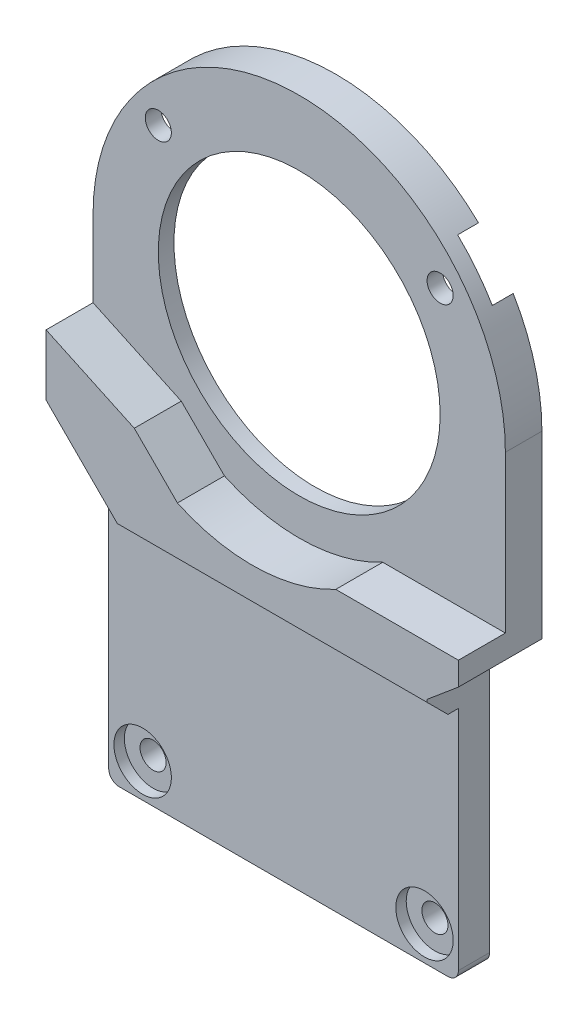
ISO-10303-21;
HEADER;
FILE_DESCRIPTION(('STEP AP214'),'2;1');
FILE_NAME('part.step','',(''),(''),'','','');
FILE_SCHEMA(('AUTOMOTIVE_DESIGN { 1 0 10303 214 1 1 1 1 }'));
ENDSEC;
DATA;
#1=APPLICATION_CONTEXT('core data for automotive mechanical design processes');
#2=APPLICATION_PROTOCOL_DEFINITION('international standard','automotive_design',2000,#1);
#3=PRODUCT_CONTEXT('',#1,'mechanical');
#4=PRODUCT('Part','Part','',(#3));
#5=PRODUCT_RELATED_PRODUCT_CATEGORY('part','',(#4));
#6=PRODUCT_DEFINITION_FORMATION('','',#4);
#7=PRODUCT_DEFINITION_CONTEXT('part definition',#1,'design');
#8=PRODUCT_DEFINITION('design','',#6,#7);
#9=PRODUCT_DEFINITION_SHAPE('','',#8);
#10=(LENGTH_UNIT() NAMED_UNIT(*) SI_UNIT(.MILLI.,.METRE.));
#11=(NAMED_UNIT(*) PLANE_ANGLE_UNIT() SI_UNIT($,.RADIAN.));
#12=(NAMED_UNIT(*) SI_UNIT($,.STERADIAN.) SOLID_ANGLE_UNIT());
#13=UNCERTAINTY_MEASURE_WITH_UNIT(LENGTH_MEASURE(1.E-05),#10,'distance_accuracy_value','');
#14=(GEOMETRIC_REPRESENTATION_CONTEXT(3) GLOBAL_UNCERTAINTY_ASSIGNED_CONTEXT((#13)) GLOBAL_UNIT_ASSIGNED_CONTEXT((#10,
#11,#12)) REPRESENTATION_CONTEXT('',''));
#15=CARTESIAN_POINT('',(0.,0.,0.));
#16=DIRECTION('',(0.,0.,1.));
#17=DIRECTION('',(1.,0.,0.));
#18=AXIS2_PLACEMENT_3D('',#15,#16,#17);
#19=CARTESIAN_POINT('',(0.,0.,0.));
#20=DIRECTION('',(0.,0.,-1.));
#21=DIRECTION('',(1.,0.,0.));
#22=AXIS2_PLACEMENT_3D('',#19,#20,#21);
#23=PLANE('',#22);
#24=CARTESIAN_POINT('',(-13.5,-41.5,0.));
#25=DIRECTION('',(0.,0.,-1.));
#26=DIRECTION('',(-1.,0.,0.));
#27=AXIS2_PLACEMENT_3D('',#24,#25,#26);
#28=CIRCLE('',#27,2.75);
#29=CARTESIAN_POINT('',(-16.25,-41.5,0.));
#30=VERTEX_POINT('',#29);
#31=EDGE_CURVE('E308',#30,#30,#28,.T.);
#32=ORIENTED_EDGE('',*,*,#31,.T.);
#33=EDGE_LOOP('',(#32));
#34=FACE_BOUND('',#33,.T.);
#35=CARTESIAN_POINT('',(13.5,-41.5,0.));
#36=DIRECTION('',(0.,0.,-1.));
#37=DIRECTION('',(-1.,0.,0.));
#38=AXIS2_PLACEMENT_3D('',#35,#36,#37);
#39=CIRCLE('',#38,2.75);
#40=CARTESIAN_POINT('',(10.75,-41.5,0.));
#41=VERTEX_POINT('',#40);
#42=EDGE_CURVE('E305',#41,#41,#39,.T.);
#43=ORIENTED_EDGE('',*,*,#42,.T.);
#44=EDGE_LOOP('',(#43));
#45=FACE_BOUND('',#44,.T.);
#46=DIRECTION('',(1.,0.,0.));
#47=VECTOR('',#46,1.);
#48=CARTESIAN_POINT('',(-16.7500000000001,-44.75,0.));
#49=LINE('',#48,#47);
#50=CARTESIAN_POINT('',(-15.7500000000001,-44.75,0.));
#51=VERTEX_POINT('',#50);
#52=CARTESIAN_POINT('',(15.7500000000001,-44.75,0.));
#53=VERTEX_POINT('',#52);
#54=EDGE_CURVE('E335',#51,#53,#49,.T.);
#55=ORIENTED_EDGE('',*,*,#54,.T.);
#56=CARTESIAN_POINT('',(15.7500000000001,-43.75,0.));
#57=DIRECTION('',(0.,0.,1.));
#58=DIRECTION('',(1.,0.,0.));
#59=AXIS2_PLACEMENT_3D('',#56,#57,#58);
#60=CIRCLE('',#59,1.);
#61=CARTESIAN_POINT('',(16.7500000000001,-43.75,0.));
#62=VERTEX_POINT('',#61);
#63=EDGE_CURVE('E402',#62,#53,#60,.F.);
#64=ORIENTED_EDGE('',*,*,#63,.F.);
#65=DIRECTION('',(0.,1.,0.));
#66=VECTOR('',#65,1.);
#67=CARTESIAN_POINT('',(16.75,-19.75,0.));
#68=LINE('',#67,#66);
#69=CARTESIAN_POINT('',(16.75,-22.,0.));
#70=VERTEX_POINT('',#69);
#71=EDGE_CURVE('E317',#62,#70,#68,.T.);
#72=ORIENTED_EDGE('',*,*,#71,.T.);
#73=DIRECTION('',(-1.,0.,0.));
#74=VECTOR('',#73,1.);
#75=CARTESIAN_POINT('',(16.7500000000001,-22.,0.));
#76=LINE('',#75,#74);
#77=CARTESIAN_POINT('',(-13.7500000000001,-22.,0.));
#78=VERTEX_POINT('',#77);
#79=EDGE_CURVE('E397',#70,#78,#76,.T.);
#80=ORIENTED_EDGE('',*,*,#79,.T.);
#81=DIRECTION('',(-0.707106781186548,0.707106781186548,0.));
#82=VECTOR('',#81,1.);
#83=CARTESIAN_POINT('',(-16.7500000000001,-19.,0.));
#84=LINE('',#83,#82);
#85=CARTESIAN_POINT('',(-16.7500000000001,-19.,0.));
#86=VERTEX_POINT('',#85);
#87=EDGE_CURVE('E426',#78,#86,#84,.T.);
#88=ORIENTED_EDGE('',*,*,#87,.T.);
#89=DIRECTION('',(0.,-1.,0.));
#90=VECTOR('',#89,1.);
#91=CARTESIAN_POINT('',(-16.7500000000001,-16.75,0.));
#92=LINE('',#91,#90);
#93=CARTESIAN_POINT('',(-16.7500000000001,-43.75,0.));
#94=VERTEX_POINT('',#93);
#95=EDGE_CURVE('E332',#86,#94,#92,.T.);
#96=ORIENTED_EDGE('',*,*,#95,.T.);
#97=CARTESIAN_POINT('',(-15.7500000000001,-43.75,0.));
#98=DIRECTION('',(0.,0.,1.));
#99=DIRECTION('',(1.,0.,0.));
#100=AXIS2_PLACEMENT_3D('',#97,#98,#99);
#101=CIRCLE('',#100,1.);
#102=EDGE_CURVE('E405',#51,#94,#101,.F.);
#103=ORIENTED_EDGE('',*,*,#102,.F.);
#104=EDGE_LOOP('',(#55,#64,#72,#80,#88,#96,#103));
#105=FACE_BOUND('',#104,.T.);
#106=ADVANCED_FACE('F43',(#34,#45,#105),#23,.F.);
#107=CARTESIAN_POINT('',(-13.5,-41.5,-5.));
#108=DIRECTION('',(0.,0.,1.));
#109=DIRECTION('',(-1.,0.,0.));
#110=AXIS2_PLACEMENT_3D('',#107,#108,#109);
#111=CYLINDRICAL_SURFACE('',#110,1.25000000000001);
#112=CARTESIAN_POINT('',(-13.5,-41.5,-1.));
#113=DIRECTION('',(0.,0.,-1.));
#114=DIRECTION('',(-1.,0.,0.));
#115=AXIS2_PLACEMENT_3D('',#112,#113,#114);
#116=CIRCLE('',#115,1.25000000000001);
#117=CARTESIAN_POINT('',(-14.75,-41.5,-1.));
#118=VERTEX_POINT('',#117);
#119=EDGE_CURVE('E336',#118,#118,#116,.T.);
#120=ORIENTED_EDGE('',*,*,#119,.F.);
#121=EDGE_LOOP('',(#120));
#122=FACE_BOUND('',#121,.T.);
#123=CARTESIAN_POINT('',(-13.5,-41.5,-3.));
#124=DIRECTION('',(0.,0.,1.));
#125=DIRECTION('',(1.,0.,0.));
#126=AXIS2_PLACEMENT_3D('',#123,#124,#125);
#127=CIRCLE('',#126,1.25000000000001);
#128=CARTESIAN_POINT('',(-12.25,-41.5,-3.));
#129=VERTEX_POINT('',#128);
#130=EDGE_CURVE('E291',#129,#129,#127,.T.);
#131=ORIENTED_EDGE('',*,*,#130,.F.);
#132=EDGE_LOOP('',(#131));
#133=FACE_BOUND('',#132,.T.);
#134=ADVANCED_FACE('F516',(#122,#133),#111,.F.);
#135=CARTESIAN_POINT('',(13.5,-41.5,-5.));
#136=DIRECTION('',(0.,0.,1.));
#137=DIRECTION('',(-1.,0.,0.));
#138=AXIS2_PLACEMENT_3D('',#135,#136,#137);
#139=CYLINDRICAL_SURFACE('',#138,1.25000000000001);
#140=CARTESIAN_POINT('',(13.5,-41.5,-1.));
#141=DIRECTION('',(0.,0.,-1.));
#142=DIRECTION('',(-1.,0.,0.));
#143=AXIS2_PLACEMENT_3D('',#140,#141,#142);
#144=CIRCLE('',#143,1.25000000000001);
#145=CARTESIAN_POINT('',(12.25,-41.5,-1.));
#146=VERTEX_POINT('',#145);
#147=EDGE_CURVE('E304',#146,#146,#144,.T.);
#148=ORIENTED_EDGE('',*,*,#147,.F.);
#149=EDGE_LOOP('',(#148));
#150=FACE_BOUND('',#149,.T.);
#151=CARTESIAN_POINT('',(13.5,-41.5,-3.));
#152=DIRECTION('',(0.,0.,1.));
#153=DIRECTION('',(1.,0.,0.));
#154=AXIS2_PLACEMENT_3D('',#151,#152,#153);
#155=CIRCLE('',#154,1.25000000000001);
#156=CARTESIAN_POINT('',(14.75,-41.5,-3.));
#157=VERTEX_POINT('',#156);
#158=EDGE_CURVE('E288',#157,#157,#155,.T.);
#159=ORIENTED_EDGE('',*,*,#158,.F.);
#160=EDGE_LOOP('',(#159));
#161=FACE_BOUND('',#160,.T.);
#162=ADVANCED_FACE('F512',(#150,#161),#139,.F.);
#163=CARTESIAN_POINT('',(0.,0.,-5.));
#164=DIRECTION('',(0.,0.,-1.));
#165=DIRECTION('',(1.,0.,0.));
#166=AXIS2_PLACEMENT_3D('',#163,#164,#165);
#167=PLANE('',#166);
#168=DIRECTION('',(0.,1.,0.));
#169=VECTOR('',#168,1.);
#170=CARTESIAN_POINT('',(17.,-44.75,-5.));
#171=LINE('',#170,#169);
#172=CARTESIAN_POINT('',(17.,-19.5402250922056,-5.));
#173=VERTEX_POINT('',#172);
#174=CARTESIAN_POINT('',(17.,10.0529846314417,-5.));
#175=VERTEX_POINT('',#174);
#176=EDGE_CURVE('E248',#173,#175,#171,.T.);
#177=ORIENTED_EDGE('',*,*,#176,.T.);
#178=CARTESIAN_POINT('',(0.,0.,-5.));
#179=DIRECTION('',(0.,0.,1.));
#180=DIRECTION('',(1.,0.,0.));
#181=AXIS2_PLACEMENT_3D('',#178,#179,#180);
#182=CIRCLE('',#181,19.7500000000001);
#183=CARTESIAN_POINT('',(19.7500000000001,0.,-5.));
#184=VERTEX_POINT('',#183);
#185=EDGE_CURVE('E321',#184,#175,#182,.T.);
#186=ORIENTED_EDGE('',*,*,#185,.F.);
#187=DIRECTION('',(0.,1.,0.));
#188=VECTOR('',#187,1.);
#189=CARTESIAN_POINT('',(19.7500000000001,-17.2327011064682,-5.));
#190=LINE('',#189,#188);
#191=CARTESIAN_POINT('',(19.7500000000001,-17.2327011064682,-5.));
#192=VERTEX_POINT('',#191);
#193=EDGE_CURVE('E316',#192,#184,#190,.T.);
#194=ORIENTED_EDGE('',*,*,#193,.F.);
#195=DIRECTION('',(0.766044443118993,0.642787609686521,0.));
#196=VECTOR('',#195,1.);
#197=CARTESIAN_POINT('',(16.75,-19.75,-5.));
#198=LINE('',#197,#196);
#199=EDGE_CURVE('E313',#173,#192,#198,.T.);
#200=ORIENTED_EDGE('',*,*,#199,.F.);
#201=EDGE_LOOP('',(#177,#186,#194,#200));
#202=FACE_BOUND('',#201,.T.);
#203=ADVANCED_FACE('F499',(#202),#167,.T.);
#204=DIRECTION('',(0.,-1.,0.));
#205=VECTOR('',#204,1.);
#206=CARTESIAN_POINT('',(-17.,-44.75,-5.));
#207=LINE('',#206,#205);
#208=CARTESIAN_POINT('',(-17.,10.0529846314417,-5.));
#209=VERTEX_POINT('',#208);
#210=CARTESIAN_POINT('',(-17.,-16.5000000000001,-5.));
#211=VERTEX_POINT('',#210);
#212=EDGE_CURVE('E252',#209,#211,#207,.T.);
#213=ORIENTED_EDGE('',*,*,#212,.T.);
#214=DIRECTION('',(0.707106781186547,-0.707106781186547,0.));
#215=VECTOR('',#214,1.);
#216=CARTESIAN_POINT('',(-16.7500000000001,-16.75,-5.));
#217=LINE('',#216,#215);
#218=CARTESIAN_POINT('',(-19.7500000000001,-13.75,-5.));
#219=VERTEX_POINT('',#218);
#220=EDGE_CURVE('E328',#219,#211,#217,.T.);
#221=ORIENTED_EDGE('',*,*,#220,.F.);
#222=DIRECTION('',(0.,-1.,0.));
#223=VECTOR('',#222,1.);
#224=CARTESIAN_POINT('',(-19.7500000000001,-13.75,-5.));
#225=LINE('',#224,#223);
#226=CARTESIAN_POINT('',(-19.7500000000001,0.,-5.));
#227=VERTEX_POINT('',#226);
#228=EDGE_CURVE('E324',#227,#219,#225,.T.);
#229=ORIENTED_EDGE('',*,*,#228,.F.);
#230=EDGE_CURVE('E320',#209,#227,#182,.T.);
#231=ORIENTED_EDGE('',*,*,#230,.F.);
#232=EDGE_LOOP('',(#213,#221,#229,#231));
#233=FACE_BOUND('',#232,.T.);
#234=ADVANCED_FACE('F493',(#233),#167,.T.);
#235=CARTESIAN_POINT('',(-16.7500000000001,-16.75,-5.));
#236=DIRECTION('',(1.,0.,0.));
#237=DIRECTION('',(0.,1.,0.));
#238=AXIS2_PLACEMENT_3D('',#235,#236,#237);
#239=PLANE('',#238);
#240=ORIENTED_EDGE('',*,*,#95,.F.);
#241=DIRECTION('',(0.,0.,-1.));
#242=VECTOR('',#241,1.);
#243=CARTESIAN_POINT('',(-16.7500000000001,-19.,3.));
#244=LINE('',#243,#242);
#245=CARTESIAN_POINT('',(-16.7500000000001,-19.,0.999999999999984));
#246=VERTEX_POINT('',#245);
#247=EDGE_CURVE('E431',#246,#86,#244,.T.);
#248=ORIENTED_EDGE('',*,*,#247,.F.);
#249=DIRECTION('',(0.,-0.816496580927726,-0.577350269189627));
#250=VECTOR('',#249,1.);
#251=CARTESIAN_POINT('',(-16.7500000000001,-16.3643819168359,2.86366341922323));
#252=LINE('',#251,#250);
#253=CARTESIAN_POINT('',(-16.7500000000001,-16.75,2.59099025766972));
#254=VERTEX_POINT('',#253);
#255=EDGE_CURVE('E383',#254,#246,#252,.T.);
#256=ORIENTED_EDGE('',*,*,#255,.F.);
#257=DIRECTION('',(0.,0.,1.));
#258=VECTOR('',#257,1.);
#259=CARTESIAN_POINT('',(-16.7500000000001,-16.75,-5.));
#260=LINE('',#259,#258);
#261=CARTESIAN_POINT('',(-16.7500000000001,-16.75,-3.));
#262=VERTEX_POINT('',#261);
#263=EDGE_CURVE('E331',#262,#254,#260,.T.);
#264=ORIENTED_EDGE('',*,*,#263,.F.);
#265=DIRECTION('',(0.,-1.,0.));
#266=VECTOR('',#265,1.);
#267=CARTESIAN_POINT('',(-16.7500000000001,-16.75,-3.));
#268=LINE('',#267,#266);
#269=CARTESIAN_POINT('',(-16.7500000000001,-43.75,-3.));
#270=VERTEX_POINT('',#269);
#271=EDGE_CURVE('E275',#262,#270,#268,.T.);
#272=ORIENTED_EDGE('',*,*,#271,.T.);
#273=DIRECTION('',(0.,0.,1.));
#274=VECTOR('',#273,1.);
#275=CARTESIAN_POINT('',(-16.7500000000001,-43.75,-5.));
#276=LINE('',#275,#274);
#277=EDGE_CURVE('E408',#94,#270,#276,.F.);
#278=ORIENTED_EDGE('',*,*,#277,.F.);
#279=EDGE_LOOP('',(#240,#248,#256,#264,#272,#278));
#280=FACE_BOUND('',#279,.T.);
#281=ADVANCED_FACE('F429',(#280),#239,.F.);
#282=CARTESIAN_POINT('',(-16.7500000000001,-44.75,-5.));
#283=DIRECTION('',(0.,1.,0.));
#284=DIRECTION('',(-1.,0.,0.));
#285=AXIS2_PLACEMENT_3D('',#282,#283,#284);
#286=PLANE('',#285);
#287=DIRECTION('',(1.,0.,0.));
#288=VECTOR('',#287,1.);
#289=CARTESIAN_POINT('',(17.,-44.75,-3.));
#290=LINE('',#289,#288);
#291=CARTESIAN_POINT('',(-15.7500000000001,-44.75,-3.));
#292=VERTEX_POINT('',#291);
#293=CARTESIAN_POINT('',(15.7500000000001,-44.75,-3.));
#294=VERTEX_POINT('',#293);
#295=EDGE_CURVE('E256',#292,#294,#290,.T.);
#296=ORIENTED_EDGE('',*,*,#295,.T.);
#297=DIRECTION('',(0.,0.,1.));
#298=VECTOR('',#297,1.);
#299=CARTESIAN_POINT('',(15.7500000000001,-44.75,-5.));
#300=LINE('',#299,#298);
#301=EDGE_CURVE('E394',#53,#294,#300,.F.);
#302=ORIENTED_EDGE('',*,*,#301,.F.);
#303=ORIENTED_EDGE('',*,*,#54,.F.);
#304=DIRECTION('',(0.,0.,1.));
#305=VECTOR('',#304,1.);
#306=CARTESIAN_POINT('',(-15.7500000000001,-44.75,-5.));
#307=LINE('',#306,#305);
#308=EDGE_CURVE('E400',#292,#51,#307,.T.);
#309=ORIENTED_EDGE('',*,*,#308,.F.);
#310=EDGE_LOOP('',(#296,#302,#303,#309));
#311=FACE_BOUND('',#310,.T.);
#312=ADVANCED_FACE('F416',(#311),#286,.F.);
#313=CARTESIAN_POINT('',(16.75,-19.75,-5.));
#314=DIRECTION('',(-1.,0.,0.));
#315=DIRECTION('',(0.,-1.,0.));
#316=AXIS2_PLACEMENT_3D('',#313,#314,#315);
#317=PLANE('',#316);
#318=DIRECTION('',(0.,1.,0.));
#319=VECTOR('',#318,1.);
#320=CARTESIAN_POINT('',(16.75,-19.75,-3.));
#321=LINE('',#320,#319);
#322=CARTESIAN_POINT('',(16.7500000000001,-43.75,-3.));
#323=VERTEX_POINT('',#322);
#324=CARTESIAN_POINT('',(16.75,-19.75,-3.));
#325=VERTEX_POINT('',#324);
#326=EDGE_CURVE('E285',#323,#325,#321,.T.);
#327=ORIENTED_EDGE('',*,*,#326,.T.);
#328=DIRECTION('',(0.,0.,1.));
#329=VECTOR('',#328,1.);
#330=CARTESIAN_POINT('',(16.75,-19.75,-5.));
#331=LINE('',#330,#329);
#332=CARTESIAN_POINT('',(16.7500000000001,-19.7499999999999,3.));
#333=VERTEX_POINT('',#332);
#334=EDGE_CURVE('E355',#325,#333,#331,.T.);
#335=ORIENTED_EDGE('',*,*,#334,.T.);
#336=DIRECTION('',(0.,-1.,0.));
#337=VECTOR('',#336,1.);
#338=CARTESIAN_POINT('',(16.7500000000001,-22.,3.));
#339=LINE('',#338,#337);
#340=CARTESIAN_POINT('',(16.7500000000001,-20.,3.));
#341=VERTEX_POINT('',#340);
#342=EDGE_CURVE('E476',#333,#341,#339,.T.);
#343=ORIENTED_EDGE('',*,*,#342,.T.);
#344=DIRECTION('',(0.,0.707106781186548,0.707106781186548));
#345=VECTOR('',#344,1.);
#346=CARTESIAN_POINT('',(16.75,-19.9999999999999,3.00000000000004));
#347=LINE('',#346,#345);
#348=CARTESIAN_POINT('',(16.7500000000001,-22.,0.999999999999984));
#349=VERTEX_POINT('',#348);
#350=EDGE_CURVE('E391',#349,#341,#347,.T.);
#351=ORIENTED_EDGE('',*,*,#350,.F.);
#352=DIRECTION('',(0.,0.,-1.));
#353=VECTOR('',#352,1.);
#354=CARTESIAN_POINT('',(16.7500000000001,-22.,3.));
#355=LINE('',#354,#353);
#356=EDGE_CURVE('E239',#349,#70,#355,.T.);
#357=ORIENTED_EDGE('',*,*,#356,.T.);
#358=ORIENTED_EDGE('',*,*,#71,.F.);
#359=DIRECTION('',(0.,0.,1.));
#360=VECTOR('',#359,1.);
#361=CARTESIAN_POINT('',(16.7500000000001,-43.75,-5.));
#362=LINE('',#361,#360);
#363=EDGE_CURVE('E12',#323,#62,#362,.T.);
#364=ORIENTED_EDGE('',*,*,#363,.F.);
#365=EDGE_LOOP('',(#327,#335,#343,#351,#357,#358,#364));
#366=FACE_BOUND('',#365,.T.);
#367=ADVANCED_FACE('F467',(#366),#317,.F.);
#368=CARTESIAN_POINT('',(0.,0.,-5.));
#369=DIRECTION('',(0.,0.,1.));
#370=DIRECTION('',(-1.,0.,0.));
#371=AXIS2_PLACEMENT_3D('',#368,#369,#370);
#372=CYLINDRICAL_SURFACE('',#371,13.5);
#373=CARTESIAN_POINT('',(0.,0.,-1.5));
#374=DIRECTION('',(0.,0.,1.));
#375=DIRECTION('',(1.,0.,0.));
#376=AXIS2_PLACEMENT_3D('',#373,#374,#375);
#377=CIRCLE('',#376,13.5);
#378=CARTESIAN_POINT('',(13.5,0.,-1.5));
#379=VERTEX_POINT('',#378);
#380=EDGE_CURVE('E398',#379,#379,#377,.T.);
#381=ORIENTED_EDGE('',*,*,#380,.T.);
#382=EDGE_LOOP('',(#381));
#383=FACE_BOUND('',#382,.T.);
#384=CARTESIAN_POINT('',(0.,0.,-3.));
#385=DIRECTION('',(0.,0.,1.));
#386=DIRECTION('',(1.,0.,0.));
#387=AXIS2_PLACEMENT_3D('',#384,#385,#386);
#388=CIRCLE('',#387,13.5);
#389=CARTESIAN_POINT('',(13.5,0.,-3.));
#390=VERTEX_POINT('',#389);
#391=EDGE_CURVE('E270',#390,#390,#388,.T.);
#392=ORIENTED_EDGE('',*,*,#391,.F.);
#393=EDGE_LOOP('',(#392));
#394=FACE_BOUND('',#393,.T.);
#395=ADVANCED_FACE('F537',(#383,#394),#372,.F.);
#396=CARTESIAN_POINT('',(-13.5,10.5,-5.));
#397=DIRECTION('',(0.,0.,1.));
#398=DIRECTION('',(-1.,0.,0.));
#399=AXIS2_PLACEMENT_3D('',#396,#397,#398);
#400=CYLINDRICAL_SURFACE('',#399,1.25);
#401=CARTESIAN_POINT('',(-13.5,10.5,-1.5));
#402=DIRECTION('',(0.,0.,1.));
#403=DIRECTION('',(1.,0.,0.));
#404=AXIS2_PLACEMENT_3D('',#401,#402,#403);
#405=CIRCLE('',#404,1.25);
#406=CARTESIAN_POINT('',(-12.25,10.5,-1.5));
#407=VERTEX_POINT('',#406);
#408=EDGE_CURVE('E622',#407,#407,#405,.T.);
#409=ORIENTED_EDGE('',*,*,#408,.T.);
#410=EDGE_LOOP('',(#409));
#411=FACE_BOUND('',#410,.T.);
#412=CARTESIAN_POINT('',(-13.5,10.5,-3.));
#413=DIRECTION('',(0.,0.,1.));
#414=DIRECTION('',(1.,0.,0.));
#415=AXIS2_PLACEMENT_3D('',#412,#413,#414);
#416=CIRCLE('',#415,1.25);
#417=CARTESIAN_POINT('',(-12.25,10.5,-3.));
#418=VERTEX_POINT('',#417);
#419=EDGE_CURVE('E267',#418,#418,#416,.T.);
#420=ORIENTED_EDGE('',*,*,#419,.F.);
#421=EDGE_LOOP('',(#420));
#422=FACE_BOUND('',#421,.T.);
#423=ADVANCED_FACE('F506',(#411,#422),#400,.F.);
#424=CARTESIAN_POINT('',(13.5,10.5,-5.));
#425=DIRECTION('',(0.,0.,1.));
#426=DIRECTION('',(-1.,0.,0.));
#427=AXIS2_PLACEMENT_3D('',#424,#425,#426);
#428=CYLINDRICAL_SURFACE('',#427,1.25);
#429=CARTESIAN_POINT('',(13.5,10.5,-1.5));
#430=DIRECTION('',(0.,0.,1.));
#431=DIRECTION('',(1.,0.,0.));
#432=AXIS2_PLACEMENT_3D('',#429,#430,#431);
#433=CIRCLE('',#432,1.25);
#434=CARTESIAN_POINT('',(14.75,10.5,-1.5));
#435=VERTEX_POINT('',#434);
#436=EDGE_CURVE('E625',#435,#435,#433,.T.);
#437=ORIENTED_EDGE('',*,*,#436,.T.);
#438=EDGE_LOOP('',(#437));
#439=FACE_BOUND('',#438,.T.);
#440=CARTESIAN_POINT('',(13.5,10.5,-3.));
#441=DIRECTION('',(0.,0.,1.));
#442=DIRECTION('',(1.,0.,0.));
#443=AXIS2_PLACEMENT_3D('',#440,#441,#442);
#444=CIRCLE('',#443,1.25);
#445=CARTESIAN_POINT('',(14.75,10.5,-3.));
#446=VERTEX_POINT('',#445);
#447=EDGE_CURVE('E259',#446,#446,#444,.T.);
#448=ORIENTED_EDGE('',*,*,#447,.F.);
#449=EDGE_LOOP('',(#448));
#450=FACE_BOUND('',#449,.T.);
#451=ADVANCED_FACE('F497',(#439,#450),#428,.F.);
#452=DIRECTION('',(-1.,0.,0.));
#453=VECTOR('',#452,1.);
#454=CARTESIAN_POINT('',(17.,14.25,-5.));
#455=LINE('',#454,#453);
#456=CARTESIAN_POINT('',(13.6747943311775,14.25,-5.));
#457=VERTEX_POINT('',#456);
#458=CARTESIAN_POINT('',(-13.6747943311775,14.25,-5.));
#459=VERTEX_POINT('',#458);
#460=EDGE_CURVE('E262',#457,#459,#455,.T.);
#461=ORIENTED_EDGE('',*,*,#460,.T.);
#462=EDGE_CURVE('E325',#457,#459,#182,.T.);
#463=ORIENTED_EDGE('',*,*,#462,.F.);
#464=EDGE_LOOP('',(#461,#463));
#465=FACE_BOUND('',#464,.T.);
#466=ADVANCED_FACE('F495',(#465),#167,.T.);
#467=CARTESIAN_POINT('',(16.75,-19.75,-5.));
#468=DIRECTION('',(-0.642787609686521,0.766044443118993,0.));
#469=DIRECTION('',(-0.766044443118993,-0.642787609686521,0.));
#470=AXIS2_PLACEMENT_3D('',#467,#468,#469);
#471=PLANE('',#470);
#472=ORIENTED_EDGE('',*,*,#199,.T.);
#473=DIRECTION('',(0.,0.,1.));
#474=VECTOR('',#473,1.);
#475=CARTESIAN_POINT('',(19.7500000000001,-17.2327011064682,-5.));
#476=LINE('',#475,#474);
#477=CARTESIAN_POINT('',(19.7500000000001,-17.2327011064682,3.));
#478=VERTEX_POINT('',#477);
#479=EDGE_CURVE('E352',#192,#478,#476,.T.);
#480=ORIENTED_EDGE('',*,*,#479,.T.);
#481=DIRECTION('',(-0.766044443118993,-0.642787609686521,0.));
#482=VECTOR('',#481,1.);
#483=CARTESIAN_POINT('',(16.7500000000001,-19.7499999999999,3.));
#484=LINE('',#483,#482);
#485=EDGE_CURVE('E463',#478,#333,#484,.T.);
#486=ORIENTED_EDGE('',*,*,#485,.T.);
#487=ORIENTED_EDGE('',*,*,#334,.F.);
#488=DIRECTION('',(0.766044443118993,0.642787609686521,0.));
#489=VECTOR('',#488,1.);
#490=CARTESIAN_POINT('',(16.75,-19.75,-3.));
#491=LINE('',#490,#489);
#492=CARTESIAN_POINT('',(17.,-19.5402250922056,-3.));
#493=VERTEX_POINT('',#492);
#494=EDGE_CURVE('E282',#325,#493,#491,.T.);
#495=ORIENTED_EDGE('',*,*,#494,.T.);
#496=DIRECTION('',(0.,0.,1.));
#497=VECTOR('',#496,1.);
#498=CARTESIAN_POINT('',(17.,-19.5402250922056,-5.));
#499=LINE('',#498,#497);
#500=EDGE_CURVE('E297',#173,#493,#499,.T.);
#501=ORIENTED_EDGE('',*,*,#500,.F.);
#502=EDGE_LOOP('',(#472,#480,#486,#487,#495,#501));
#503=FACE_BOUND('',#502,.T.);
#504=ADVANCED_FACE('F461',(#503),#471,.F.);
#505=CARTESIAN_POINT('',(19.7500000000001,-17.2327011064682,-5.));
#506=DIRECTION('',(-1.,0.,0.));
#507=DIRECTION('',(0.,0.,-1.));
#508=AXIS2_PLACEMENT_3D('',#505,#506,#507);
#509=PLANE('',#508);
#510=DIRECTION('',(0.,0.,-1.));
#511=VECTOR('',#510,1.);
#512=CARTESIAN_POINT('',(19.7500000000001,-15.,3.));
#513=LINE('',#512,#511);
#514=CARTESIAN_POINT('',(19.7500000000001,-15.,3.));
#515=VERTEX_POINT('',#514);
#516=CARTESIAN_POINT('',(19.7500000000001,-15.,-1.5));
#517=VERTEX_POINT('',#516);
#518=EDGE_CURVE('E219',#515,#517,#513,.T.);
#519=ORIENTED_EDGE('',*,*,#518,.F.);
#520=DIRECTION('',(0.,-1.,0.));
#521=VECTOR('',#520,1.);
#522=CARTESIAN_POINT('',(19.7500000000001,-17.2327011064682,3.));
#523=LINE('',#522,#521);
#524=EDGE_CURVE('E640',#515,#478,#523,.T.);
#525=ORIENTED_EDGE('',*,*,#524,.T.);
#526=ORIENTED_EDGE('',*,*,#479,.F.);
#527=ORIENTED_EDGE('',*,*,#193,.T.);
#528=DIRECTION('',(0.,0.,1.));
#529=VECTOR('',#528,1.);
#530=CARTESIAN_POINT('',(19.7500000000001,0.,-5.));
#531=LINE('',#530,#529);
#532=CARTESIAN_POINT('',(19.7500000000001,0.,-1.5));
#533=VERTEX_POINT('',#532);
#534=EDGE_CURVE('E349',#184,#533,#531,.T.);
#535=ORIENTED_EDGE('',*,*,#534,.T.);
#536=DIRECTION('',(0.,-1.,0.));
#537=VECTOR('',#536,1.);
#538=CARTESIAN_POINT('',(19.7500000000001,0.,-1.5));
#539=LINE('',#538,#537);
#540=EDGE_CURVE('E653',#533,#517,#539,.T.);
#541=ORIENTED_EDGE('',*,*,#540,.T.);
#542=EDGE_LOOP('',(#519,#525,#526,#527,#535,#541));
#543=FACE_BOUND('',#542,.T.);
#544=ADVANCED_FACE('F504',(#543),#509,.F.);
#545=CARTESIAN_POINT('',(0.,0.,-5.));
#546=DIRECTION('',(0.,0.,1.));
#547=DIRECTION('',(-1.,0.,0.));
#548=AXIS2_PLACEMENT_3D('',#545,#546,#547);
#549=CYLINDRICAL_SURFACE('',#548,19.7500000000001);
#550=ORIENTED_EDGE('',*,*,#534,.F.);
#551=ORIENTED_EDGE('',*,*,#185,.T.);
#552=DIRECTION('',(0.,0.,1.));
#553=VECTOR('',#552,1.);
#554=CARTESIAN_POINT('',(17.,10.0529846314417,-5.));
#555=LINE('',#554,#553);
#556=CARTESIAN_POINT('',(17.,10.0529846314417,-3.));
#557=VERTEX_POINT('',#556);
#558=EDGE_CURVE('E371',#557,#175,#555,.F.);
#559=ORIENTED_EDGE('',*,*,#558,.F.);
#560=CARTESIAN_POINT('',(0.,0.,-3.));
#561=DIRECTION('',(0.,0.,1.));
#562=DIRECTION('',(1.,0.,0.));
#563=AXIS2_PLACEMENT_3D('',#560,#561,#562);
#564=CIRCLE('',#563,19.7500000000001);
#565=CARTESIAN_POINT('',(13.6747943311775,14.25,-3.));
#566=VERTEX_POINT('',#565);
#567=EDGE_CURVE('E281',#557,#566,#564,.T.);
#568=ORIENTED_EDGE('',*,*,#567,.T.);
#569=DIRECTION('',(0.,0.,1.));
#570=VECTOR('',#569,1.);
#571=CARTESIAN_POINT('',(13.6747943311775,14.25,-5.));
#572=LINE('',#571,#570);
#573=EDGE_CURVE('E368',#457,#566,#572,.T.);
#574=ORIENTED_EDGE('',*,*,#573,.F.);
#575=ORIENTED_EDGE('',*,*,#462,.T.);
#576=DIRECTION('',(0.,0.,1.));
#577=VECTOR('',#576,1.);
#578=CARTESIAN_POINT('',(-13.6747943311775,14.25,-5.));
#579=LINE('',#578,#577);
#580=CARTESIAN_POINT('',(-13.6747943311775,14.25,-3.));
#581=VERTEX_POINT('',#580);
#582=EDGE_CURVE('E366',#581,#459,#579,.F.);
#583=ORIENTED_EDGE('',*,*,#582,.F.);
#584=CARTESIAN_POINT('',(-17.,10.0529846314417,-3.));
#585=VERTEX_POINT('',#584);
#586=EDGE_CURVE('E278',#581,#585,#564,.T.);
#587=ORIENTED_EDGE('',*,*,#586,.T.);
#588=DIRECTION('',(0.,0.,1.));
#589=VECTOR('',#588,1.);
#590=CARTESIAN_POINT('',(-17.,10.0529846314417,-5.));
#591=LINE('',#590,#589);
#592=EDGE_CURVE('E294',#209,#585,#591,.T.);
#593=ORIENTED_EDGE('',*,*,#592,.F.);
#594=ORIENTED_EDGE('',*,*,#230,.T.);
#595=DIRECTION('',(0.,0.,1.));
#596=VECTOR('',#595,1.);
#597=CARTESIAN_POINT('',(-19.7500000000001,0.,-5.));
#598=LINE('',#597,#596);
#599=CARTESIAN_POINT('',(-19.7500000000001,0.,-1.5));
#600=VERTEX_POINT('',#599);
#601=EDGE_CURVE('E346',#227,#600,#598,.T.);
#602=ORIENTED_EDGE('',*,*,#601,.T.);
#603=CARTESIAN_POINT('',(0.,0.,-1.5));
#604=DIRECTION('',(0.,0.,1.));
#605=DIRECTION('',(1.,0.,0.));
#606=AXIS2_PLACEMENT_3D('',#603,#604,#605);
#607=CIRCLE('',#606,19.7500000000001);
#608=EDGE_CURVE('E651',#600,#533,#607,.F.);
#609=ORIENTED_EDGE('',*,*,#608,.T.);
#610=EDGE_LOOP('',(#550,#551,#559,#568,#574,#575,#583,#587,#593,#594,#602,#609));
#611=FACE_BOUND('',#610,.T.);
#612=ADVANCED_FACE('F446',(#611),#549,.T.);
#613=CARTESIAN_POINT('',(-19.7500000000001,-13.75,-5.));
#614=DIRECTION('',(1.,0.,0.));
#615=DIRECTION('',(0.,1.,0.));
#616=AXIS2_PLACEMENT_3D('',#613,#614,#615);
#617=PLANE('',#616);
#618=ORIENTED_EDGE('',*,*,#601,.F.);
#619=ORIENTED_EDGE('',*,*,#228,.T.);
#620=DIRECTION('',(0.,0.,1.));
#621=VECTOR('',#620,1.);
#622=CARTESIAN_POINT('',(-19.7500000000001,-13.75,-5.));
#623=LINE('',#622,#621);
#624=CARTESIAN_POINT('',(-19.7500000000001,-13.75,2.59099025766972));
#625=VERTEX_POINT('',#624);
#626=EDGE_CURVE('E343',#219,#625,#623,.T.);
#627=ORIENTED_EDGE('',*,*,#626,.T.);
#628=DIRECTION('',(0.,-0.816496580927726,-0.577350269189626));
#629=VECTOR('',#628,1.);
#630=CARTESIAN_POINT('',(-19.7500000000001,-15.3643819168359,1.44944985685012));
#631=LINE('',#630,#629);
#632=CARTESIAN_POINT('',(-19.7500000000001,-13.1715728752538,3.));
#633=VERTEX_POINT('',#632);
#634=EDGE_CURVE('E378',#633,#625,#631,.T.);
#635=ORIENTED_EDGE('',*,*,#634,.F.);
#636=DIRECTION('',(0.,1.,0.));
#637=VECTOR('',#636,1.);
#638=CARTESIAN_POINT('',(-19.7500000000001,-13.75,3.));
#639=LINE('',#638,#637);
#640=CARTESIAN_POINT('',(-19.7500000000001,-7.3410925358761,3.));
#641=VERTEX_POINT('',#640);
#642=EDGE_CURVE('E473',#633,#641,#639,.T.);
#643=ORIENTED_EDGE('',*,*,#642,.T.);
#644=DIRECTION('',(0.,0.,-1.));
#645=VECTOR('',#644,1.);
#646=CARTESIAN_POINT('',(-19.7500000000001,-7.3410925358761,3.));
#647=LINE('',#646,#645);
#648=CARTESIAN_POINT('',(-19.7500000000001,-7.3410925358761,-1.5));
#649=VERTEX_POINT('',#648);
#650=EDGE_CURVE('E245',#641,#649,#647,.T.);
#651=ORIENTED_EDGE('',*,*,#650,.T.);
#652=DIRECTION('',(0.,1.,0.));
#653=VECTOR('',#652,1.);
#654=CARTESIAN_POINT('',(-19.7500000000001,-7.3410925358761,-1.5));
#655=LINE('',#654,#653);
#656=EDGE_CURVE('E646',#649,#600,#655,.T.);
#657=ORIENTED_EDGE('',*,*,#656,.T.);
#658=EDGE_LOOP('',(#618,#619,#627,#635,#643,#651,#657));
#659=FACE_BOUND('',#658,.T.);
#660=ADVANCED_FACE('F491',(#659),#617,.F.);
#661=CARTESIAN_POINT('',(-16.7500000000001,-16.75,-5.));
#662=DIRECTION('',(0.707106781186548,0.707106781186548,0.));
#663=DIRECTION('',(-0.707106781186548,0.707106781186548,0.));
#664=AXIS2_PLACEMENT_3D('',#661,#662,#663);
#665=PLANE('',#664);
#666=ORIENTED_EDGE('',*,*,#626,.F.);
#667=ORIENTED_EDGE('',*,*,#220,.T.);
#668=DIRECTION('',(0.,0.,-1.));
#669=VECTOR('',#668,1.);
#670=CARTESIAN_POINT('',(-17.,-16.5000000000001,-5.));
#671=LINE('',#670,#669);
#672=CARTESIAN_POINT('',(-17.,-16.5000000000001,-3.));
#673=VERTEX_POINT('',#672);
#674=EDGE_CURVE('E358',#673,#211,#671,.T.);
#675=ORIENTED_EDGE('',*,*,#674,.F.);
#676=DIRECTION('',(0.707106781186548,-0.707106781186548,0.));
#677=VECTOR('',#676,1.);
#678=CARTESIAN_POINT('',(-16.7500000000001,-16.75,-3.));
#679=LINE('',#678,#677);
#680=EDGE_CURVE('E273',#673,#262,#679,.T.);
#681=ORIENTED_EDGE('',*,*,#680,.T.);
#682=ORIENTED_EDGE('',*,*,#263,.T.);
#683=DIRECTION('',(0.707106781186548,-0.707106781186548,0.));
#684=VECTOR('',#683,1.);
#685=CARTESIAN_POINT('',(-16.75,-16.75,2.59099025766972));
#686=LINE('',#685,#684);
#687=EDGE_CURVE('E381',#625,#254,#686,.T.);
#688=ORIENTED_EDGE('',*,*,#687,.F.);
#689=EDGE_LOOP('',(#666,#667,#675,#681,#682,#688));
#690=FACE_BOUND('',#689,.T.);
#691=ADVANCED_FACE('F437',(#690),#665,.F.);
#692=CARTESIAN_POINT('',(13.5,-41.5,-1.));
#693=DIRECTION('',(0.,0.,1.));
#694=DIRECTION('',(-1.,0.,0.));
#695=AXIS2_PLACEMENT_3D('',#692,#693,#694);
#696=CYLINDRICAL_SURFACE('',#695,2.75);
#697=CARTESIAN_POINT('',(13.5,-41.5,-1.));
#698=DIRECTION('',(0.,0.,-1.));
#699=DIRECTION('',(-1.,0.,0.));
#700=AXIS2_PLACEMENT_3D('',#697,#698,#699);
#701=CIRCLE('',#700,2.75);
#702=CARTESIAN_POINT('',(10.75,-41.5,-1.));
#703=VERTEX_POINT('',#702);
#704=EDGE_CURVE('E301',#703,#703,#701,.T.);
#705=ORIENTED_EDGE('',*,*,#704,.T.);
#706=EDGE_LOOP('',(#705));
#707=FACE_BOUND('',#706,.T.);
#708=ORIENTED_EDGE('',*,*,#42,.F.);
#709=EDGE_LOOP('',(#708));
#710=FACE_BOUND('',#709,.T.);
#711=ADVANCED_FACE('F527',(#707,#710),#696,.F.);
#712=CARTESIAN_POINT('',(13.5,-41.5,-1.));
#713=DIRECTION('',(0.,0.,1.));
#714=DIRECTION('',(-1.,0.,0.));
#715=AXIS2_PLACEMENT_3D('',#712,#713,#714);
#716=PLANE('',#715);
#717=ORIENTED_EDGE('',*,*,#147,.T.);
#718=EDGE_LOOP('',(#717));
#719=FACE_BOUND('',#718,.T.);
#720=ORIENTED_EDGE('',*,*,#704,.F.);
#721=EDGE_LOOP('',(#720));
#722=FACE_BOUND('',#721,.T.);
#723=ADVANCED_FACE('F589',(#719,#722),#716,.T.);
#724=CARTESIAN_POINT('',(-13.5,-41.5,-1.));
#725=DIRECTION('',(0.,0.,1.));
#726=DIRECTION('',(-1.,0.,0.));
#727=AXIS2_PLACEMENT_3D('',#724,#725,#726);
#728=CYLINDRICAL_SURFACE('',#727,2.75);
#729=CARTESIAN_POINT('',(-13.5,-41.5,-1.));
#730=DIRECTION('',(0.,0.,-1.));
#731=DIRECTION('',(-1.,0.,0.));
#732=AXIS2_PLACEMENT_3D('',#729,#730,#731);
#733=CIRCLE('',#732,2.75);
#734=CARTESIAN_POINT('',(-16.25,-41.5,-1.));
#735=VERTEX_POINT('',#734);
#736=EDGE_CURVE('E300',#735,#735,#733,.T.);
#737=ORIENTED_EDGE('',*,*,#736,.T.);
#738=EDGE_LOOP('',(#737));
#739=FACE_BOUND('',#738,.T.);
#740=ORIENTED_EDGE('',*,*,#31,.F.);
#741=EDGE_LOOP('',(#740));
#742=FACE_BOUND('',#741,.T.);
#743=ADVANCED_FACE('F592',(#739,#742),#728,.F.);
#744=CARTESIAN_POINT('',(-13.5,-41.5,-1.));
#745=DIRECTION('',(0.,0.,1.));
#746=DIRECTION('',(-1.,0.,0.));
#747=AXIS2_PLACEMENT_3D('',#744,#745,#746);
#748=PLANE('',#747);
#749=ORIENTED_EDGE('',*,*,#119,.T.);
#750=EDGE_LOOP('',(#749));
#751=FACE_BOUND('',#750,.T.);
#752=ORIENTED_EDGE('',*,*,#736,.F.);
#753=EDGE_LOOP('',(#752));
#754=FACE_BOUND('',#753,.T.);
#755=ADVANCED_FACE('F588',(#751,#754),#748,.T.);
#756=CARTESIAN_POINT('',(17.,-44.75,-3.));
#757=DIRECTION('',(1.,0.,0.));
#758=DIRECTION('',(0.,0.,1.));
#759=AXIS2_PLACEMENT_3D('',#756,#757,#758);
#760=PLANE('',#759);
#761=ORIENTED_EDGE('',*,*,#176,.F.);
#762=ORIENTED_EDGE('',*,*,#500,.T.);
#763=DIRECTION('',(0.,1.,0.));
#764=VECTOR('',#763,1.);
#765=CARTESIAN_POINT('',(17.,-44.75,-3.));
#766=LINE('',#765,#764);
#767=EDGE_CURVE('E249',#493,#557,#766,.T.);
#768=ORIENTED_EDGE('',*,*,#767,.T.);
#769=ORIENTED_EDGE('',*,*,#558,.T.);
#770=EDGE_LOOP('',(#761,#762,#768,#769));
#771=FACE_BOUND('',#770,.T.);
#772=ADVANCED_FACE('F458',(#771),#760,.F.);
#773=CARTESIAN_POINT('',(17.,14.25,-3.));
#774=DIRECTION('',(0.,1.,0.));
#775=DIRECTION('',(-1.,0.,0.));
#776=AXIS2_PLACEMENT_3D('',#773,#774,#775);
#777=PLANE('',#776);
#778=ORIENTED_EDGE('',*,*,#460,.F.);
#779=ORIENTED_EDGE('',*,*,#573,.T.);
#780=DIRECTION('',(-1.,0.,0.));
#781=VECTOR('',#780,1.);
#782=CARTESIAN_POINT('',(17.,14.25,-3.));
#783=LINE('',#782,#781);
#784=EDGE_CURVE('E251',#566,#581,#783,.T.);
#785=ORIENTED_EDGE('',*,*,#784,.T.);
#786=ORIENTED_EDGE('',*,*,#582,.T.);
#787=EDGE_LOOP('',(#778,#779,#785,#786));
#788=FACE_BOUND('',#787,.T.);
#789=ADVANCED_FACE('F453',(#788),#777,.F.);
#790=CARTESIAN_POINT('',(-17.,-44.75,-3.));
#791=DIRECTION('',(-1.,0.,0.));
#792=DIRECTION('',(0.,0.,-1.));
#793=AXIS2_PLACEMENT_3D('',#790,#791,#792);
#794=PLANE('',#793);
#795=ORIENTED_EDGE('',*,*,#212,.F.);
#796=ORIENTED_EDGE('',*,*,#592,.T.);
#797=DIRECTION('',(0.,-1.,0.));
#798=VECTOR('',#797,1.);
#799=CARTESIAN_POINT('',(-17.,-44.75,-3.));
#800=LINE('',#799,#798);
#801=EDGE_CURVE('E254',#585,#673,#800,.T.);
#802=ORIENTED_EDGE('',*,*,#801,.T.);
#803=ORIENTED_EDGE('',*,*,#674,.T.);
#804=EDGE_LOOP('',(#795,#796,#802,#803));
#805=FACE_BOUND('',#804,.T.);
#806=ADVANCED_FACE('F441',(#805),#794,.F.);
#807=CARTESIAN_POINT('',(0.,0.,-3.));
#808=DIRECTION('',(0.,0.,-1.));
#809=DIRECTION('',(1.,0.,0.));
#810=AXIS2_PLACEMENT_3D('',#807,#808,#809);
#811=PLANE('',#810);
#812=ORIENTED_EDGE('',*,*,#130,.T.);
#813=EDGE_LOOP('',(#812));
#814=FACE_BOUND('',#813,.T.);
#815=ORIENTED_EDGE('',*,*,#158,.T.);
#816=EDGE_LOOP('',(#815));
#817=FACE_BOUND('',#816,.T.);
#818=ORIENTED_EDGE('',*,*,#391,.T.);
#819=EDGE_LOOP('',(#818));
#820=FACE_BOUND('',#819,.T.);
#821=ORIENTED_EDGE('',*,*,#419,.T.);
#822=EDGE_LOOP('',(#821));
#823=FACE_BOUND('',#822,.T.);
#824=ORIENTED_EDGE('',*,*,#447,.T.);
#825=EDGE_LOOP('',(#824));
#826=FACE_BOUND('',#825,.T.);
#827=ORIENTED_EDGE('',*,*,#271,.F.);
#828=ORIENTED_EDGE('',*,*,#680,.F.);
#829=ORIENTED_EDGE('',*,*,#801,.F.);
#830=ORIENTED_EDGE('',*,*,#586,.F.);
#831=ORIENTED_EDGE('',*,*,#784,.F.);
#832=ORIENTED_EDGE('',*,*,#567,.F.);
#833=ORIENTED_EDGE('',*,*,#767,.F.);
#834=ORIENTED_EDGE('',*,*,#494,.F.);
#835=ORIENTED_EDGE('',*,*,#326,.F.);
#836=CARTESIAN_POINT('',(15.7500000000001,-43.75,-3.));
#837=DIRECTION('',(0.,0.,1.));
#838=DIRECTION('',(1.,0.,0.));
#839=AXIS2_PLACEMENT_3D('',#836,#837,#838);
#840=CIRCLE('',#839,1.);
#841=EDGE_CURVE('E57',#294,#323,#840,.T.);
#842=ORIENTED_EDGE('',*,*,#841,.F.);
#843=ORIENTED_EDGE('',*,*,#295,.F.);
#844=CARTESIAN_POINT('',(-15.7500000000001,-43.75,-3.));
#845=DIRECTION('',(0.,0.,1.));
#846=DIRECTION('',(1.,0.,0.));
#847=AXIS2_PLACEMENT_3D('',#844,#845,#846);
#848=CIRCLE('',#847,1.);
#849=EDGE_CURVE('E51',#270,#292,#848,.T.);
#850=ORIENTED_EDGE('',*,*,#849,.F.);
#851=EDGE_LOOP('',(#827,#828,#829,#830,#831,#832,#833,#834,#835,#842,#843,#850));
#852=FACE_BOUND('',#851,.T.);
#853=ADVANCED_FACE('F417',(#814,#817,#820,#823,#826,#852),#811,.T.);
#854=CARTESIAN_POINT('',(-11.3007560879156,-11.2810396777006,3.));
#855=DIRECTION('',(-0.422618261740701,-0.906307787036649,0.));
#856=DIRECTION('',(0.906307787036649,-0.422618261740701,0.));
#857=AXIS2_PLACEMENT_3D('',#854,#855,#856);
#858=PLANE('',#857);
#859=ORIENTED_EDGE('',*,*,#650,.F.);
#860=DIRECTION('',(0.906307787036649,-0.422618261740701,0.));
#861=VECTOR('',#860,1.);
#862=CARTESIAN_POINT('',(-11.3007560879156,-11.2810396777006,3.));
#863=LINE('',#862,#861);
#864=CARTESIAN_POINT('',(-11.3007560879156,-11.2810396777006,3.));
#865=VERTEX_POINT('',#864);
#866=EDGE_CURVE('E631',#641,#865,#863,.T.);
#867=ORIENTED_EDGE('',*,*,#866,.T.);
#868=DIRECTION('',(0.,0.,-1.));
#869=VECTOR('',#868,1.);
#870=CARTESIAN_POINT('',(-11.3007560879156,-11.2810396777006,3.));
#871=LINE('',#870,#869);
#872=CARTESIAN_POINT('',(-11.3007560879156,-11.2810396777006,-1.5));
#873=VERTEX_POINT('',#872);
#874=EDGE_CURVE('E237',#865,#873,#871,.T.);
#875=ORIENTED_EDGE('',*,*,#874,.T.);
#876=DIRECTION('',(-0.906307787036649,0.422618261740701,0.));
#877=VECTOR('',#876,1.);
#878=CARTESIAN_POINT('',(-11.3007560879156,-11.2810396777006,-1.5));
#879=LINE('',#878,#877);
#880=EDGE_CURVE('E648',#873,#649,#879,.T.);
#881=ORIENTED_EDGE('',*,*,#880,.T.);
#882=EDGE_LOOP('',(#859,#867,#875,#881));
#883=FACE_BOUND('',#882,.T.);
#884=ADVANCED_FACE('F574',(#883),#858,.F.);
#885=CARTESIAN_POINT('',(-11.3007560879156,-11.2810396777006,3.));
#886=DIRECTION('',(-0.707106781186544,-0.707106781186551,0.));
#887=DIRECTION('',(0.707106781186551,-0.707106781186544,0.));
#888=AXIS2_PLACEMENT_3D('',#885,#886,#887);
#889=PLANE('',#888);
#890=ORIENTED_EDGE('',*,*,#874,.F.);
#891=DIRECTION('',(0.707106781186551,-0.707106781186544,0.));
#892=VECTOR('',#891,1.);
#893=CARTESIAN_POINT('',(-11.3007560879156,-11.2810396777006,3.));
#894=LINE('',#893,#892);
#895=CARTESIAN_POINT('',(-7.16589788280808,-15.4158978828081,3.));
#896=VERTEX_POINT('',#895);
#897=EDGE_CURVE('E634',#865,#896,#894,.T.);
#898=ORIENTED_EDGE('',*,*,#897,.T.);
#899=DIRECTION('',(0.,0.,-1.));
#900=VECTOR('',#899,1.);
#901=CARTESIAN_POINT('',(-7.16589788280808,-15.4158978828081,3.));
#902=LINE('',#901,#900);
#903=CARTESIAN_POINT('',(-7.16589788280808,-15.4158978828081,-1.5));
#904=VERTEX_POINT('',#903);
#905=EDGE_CURVE('E235',#896,#904,#902,.T.);
#906=ORIENTED_EDGE('',*,*,#905,.T.);
#907=DIRECTION('',(-0.707106781186551,0.707106781186544,0.));
#908=VECTOR('',#907,1.);
#909=CARTESIAN_POINT('',(-7.16589788280808,-15.4158978828081,-1.5));
#910=LINE('',#909,#908);
#911=EDGE_CURVE('E228',#904,#873,#910,.T.);
#912=ORIENTED_EDGE('',*,*,#911,.T.);
#913=EDGE_LOOP('',(#890,#898,#906,#912));
#914=FACE_BOUND('',#913,.T.);
#915=ADVANCED_FACE('F571',(#914),#889,.F.);
#916=CARTESIAN_POINT('',(0.,0.,3.));
#917=DIRECTION('',(0.,0.,-1.));
#918=DIRECTION('',(1.,0.,0.));
#919=AXIS2_PLACEMENT_3D('',#916,#917,#918);
#920=CYLINDRICAL_SURFACE('',#919,17.);
#921=ORIENTED_EDGE('',*,*,#905,.F.);
#922=CARTESIAN_POINT('',(0.,0.,3.));
#923=DIRECTION('',(0.,0.,1.));
#924=DIRECTION('',(-1.,0.,0.));
#925=AXIS2_PLACEMENT_3D('',#922,#923,#924);
#926=CIRCLE('',#925,17.);
#927=CARTESIAN_POINT('',(8.,-15.,3.));
#928=VERTEX_POINT('',#927);
#929=EDGE_CURVE('E234',#896,#928,#926,.T.);
#930=ORIENTED_EDGE('',*,*,#929,.T.);
#931=DIRECTION('',(0.,0.,-1.));
#932=VECTOR('',#931,1.);
#933=CARTESIAN_POINT('',(8.,-15.,3.));
#934=LINE('',#933,#932);
#935=CARTESIAN_POINT('',(8.,-15.,-1.5));
#936=VERTEX_POINT('',#935);
#937=EDGE_CURVE('E216',#928,#936,#934,.T.);
#938=ORIENTED_EDGE('',*,*,#937,.T.);
#939=CARTESIAN_POINT('',(0.,0.,-1.5));
#940=DIRECTION('',(0.,0.,1.));
#941=DIRECTION('',(1.,0.,0.));
#942=AXIS2_PLACEMENT_3D('',#939,#940,#941);
#943=CIRCLE('',#942,17.);
#944=EDGE_CURVE('E223',#936,#904,#943,.F.);
#945=ORIENTED_EDGE('',*,*,#944,.T.);
#946=EDGE_LOOP('',(#921,#930,#938,#945));
#947=FACE_BOUND('',#946,.T.);
#948=ADVANCED_FACE('F233',(#947),#920,.F.);
#949=CARTESIAN_POINT('',(19.7500000000001,-15.,3.));
#950=DIRECTION('',(0.,-1.,0.));
#951=DIRECTION('',(0.,0.,1.));
#952=AXIS2_PLACEMENT_3D('',#949,#950,#951);
#953=PLANE('',#952);
#954=ORIENTED_EDGE('',*,*,#937,.F.);
#955=DIRECTION('',(1.,0.,0.));
#956=VECTOR('',#955,1.);
#957=CARTESIAN_POINT('',(19.7500000000001,-15.,3.));
#958=LINE('',#957,#956);
#959=EDGE_CURVE('E638',#928,#515,#958,.T.);
#960=ORIENTED_EDGE('',*,*,#959,.T.);
#961=ORIENTED_EDGE('',*,*,#518,.T.);
#962=DIRECTION('',(-1.,0.,0.));
#963=VECTOR('',#962,1.);
#964=CARTESIAN_POINT('',(19.7500000000001,-15.,-1.5));
#965=LINE('',#964,#963);
#966=EDGE_CURVE('E212',#517,#936,#965,.T.);
#967=ORIENTED_EDGE('',*,*,#966,.T.);
#968=EDGE_LOOP('',(#954,#960,#961,#967));
#969=FACE_BOUND('',#968,.T.);
#970=ADVANCED_FACE('F214',(#969),#953,.F.);
#971=CARTESIAN_POINT('',(16.7500000000001,-22.,3.));
#972=DIRECTION('',(0.,1.,0.));
#973=DIRECTION('',(0.,0.,-1.));
#974=AXIS2_PLACEMENT_3D('',#971,#972,#973);
#975=PLANE('',#974);
#976=DIRECTION('',(0.,0.,-1.));
#977=VECTOR('',#976,1.);
#978=CARTESIAN_POINT('',(-13.7500000000001,-22.,3.));
#979=LINE('',#978,#977);
#980=CARTESIAN_POINT('',(-13.7500000000001,-22.,0.999999999999984));
#981=VERTEX_POINT('',#980);
#982=EDGE_CURVE('E480',#981,#78,#979,.T.);
#983=ORIENTED_EDGE('',*,*,#982,.T.);
#984=ORIENTED_EDGE('',*,*,#79,.F.);
#985=ORIENTED_EDGE('',*,*,#356,.F.);
#986=DIRECTION('',(1.,0.,0.));
#987=VECTOR('',#986,1.);
#988=CARTESIAN_POINT('',(16.7500000000001,-22.,0.999999999999984));
#989=LINE('',#988,#987);
#990=EDGE_CURVE('E389',#981,#349,#989,.T.);
#991=ORIENTED_EDGE('',*,*,#990,.F.);
#992=EDGE_LOOP('',(#983,#984,#985,#991));
#993=FACE_BOUND('',#992,.T.);
#994=ADVANCED_FACE('F483',(#993),#975,.F.);
#995=CARTESIAN_POINT('',(-16.7500000000001,-19.,3.));
#996=DIRECTION('',(0.707106781186547,0.707106781186547,0.));
#997=DIRECTION('',(-0.707106781186548,0.707106781186548,0.));
#998=AXIS2_PLACEMENT_3D('',#995,#996,#997);
#999=PLANE('',#998);
#1000=ORIENTED_EDGE('',*,*,#247,.T.);
#1001=ORIENTED_EDGE('',*,*,#87,.F.);
#1002=ORIENTED_EDGE('',*,*,#982,.F.);
#1003=DIRECTION('',(0.707106781186548,-0.707106781186548,0.));
#1004=VECTOR('',#1003,1.);
#1005=CARTESIAN_POINT('',(-13.7500000000001,-22.,0.999999999999984));
#1006=LINE('',#1005,#1004);
#1007=EDGE_CURVE('E386',#246,#981,#1006,.T.);
#1008=ORIENTED_EDGE('',*,*,#1007,.F.);
#1009=EDGE_LOOP('',(#1000,#1001,#1002,#1008));
#1010=FACE_BOUND('',#1009,.T.);
#1011=ADVANCED_FACE('F485',(#1010),#999,.F.);
#1012=CARTESIAN_POINT('',(0.,0.,3.));
#1013=DIRECTION('',(0.,0.,1.));
#1014=DIRECTION('',(-1.,0.,0.));
#1015=AXIS2_PLACEMENT_3D('',#1012,#1013,#1014);
#1016=PLANE('',#1015);
#1017=DIRECTION('',(-1.,0.,0.));
#1018=VECTOR('',#1017,1.);
#1019=CARTESIAN_POINT('',(-13.7500000000001,-20.,3.));
#1020=LINE('',#1019,#1018);
#1021=CARTESIAN_POINT('',(-12.9215728752539,-20.,3.));
#1022=VERTEX_POINT('',#1021);
#1023=EDGE_CURVE('E373',#341,#1022,#1020,.T.);
#1024=ORIENTED_EDGE('',*,*,#1023,.F.);
#1025=ORIENTED_EDGE('',*,*,#342,.F.);
#1026=ORIENTED_EDGE('',*,*,#485,.F.);
#1027=ORIENTED_EDGE('',*,*,#524,.F.);
#1028=ORIENTED_EDGE('',*,*,#959,.F.);
#1029=ORIENTED_EDGE('',*,*,#929,.F.);
#1030=ORIENTED_EDGE('',*,*,#897,.F.);
#1031=ORIENTED_EDGE('',*,*,#866,.F.);
#1032=ORIENTED_EDGE('',*,*,#642,.F.);
#1033=DIRECTION('',(-0.707106781186548,0.707106781186548,0.));
#1034=VECTOR('',#1033,1.);
#1035=CARTESIAN_POINT('',(-15.335786437627,-17.5857864376269,3.));
#1036=LINE('',#1035,#1034);
#1037=EDGE_CURVE('E376',#1022,#633,#1036,.T.);
#1038=ORIENTED_EDGE('',*,*,#1037,.F.);
#1039=EDGE_LOOP('',(#1024,#1025,#1026,#1027,#1028,#1029,#1030,#1031,#1032,#1038));
#1040=FACE_BOUND('',#1039,.T.);
#1041=ADVANCED_FACE('F546',(#1040),#1016,.T.);
#1042=CARTESIAN_POINT('',(0.,-20.,3.));
#1043=DIRECTION('',(0.,-0.707106781186547,0.707106781186547));
#1044=DIRECTION('',(1.,0.,0.));
#1045=AXIS2_PLACEMENT_3D('',#1042,#1043,#1044);
#1046=PLANE('',#1045);
#1047=ORIENTED_EDGE('',*,*,#350,.T.);
#1048=ORIENTED_EDGE('',*,*,#1023,.T.);
#1049=DIRECTION('',(0.281084637714819,0.678598344545847,0.678598344545847));
#1050=VECTOR('',#1049,1.);
#1051=CARTESIAN_POINT('',(-11.9006578342379,-17.5352930619485,5.46470693805147));
#1052=LINE('',#1051,#1050);
#1053=EDGE_CURVE('E395',#1022,#981,#1052,.F.);
#1054=ORIENTED_EDGE('',*,*,#1053,.T.);
#1055=ORIENTED_EDGE('',*,*,#990,.T.);
#1056=EDGE_LOOP('',(#1047,#1048,#1054,#1055));
#1057=FACE_BOUND('',#1056,.T.);
#1058=ADVANCED_FACE('F544',(#1057),#1046,.T.);
#1059=CARTESIAN_POINT('',(-16.4607864376269,-16.4607864376269,3.));
#1060=DIRECTION('',(-0.5,-0.5,0.707106781186547));
#1061=DIRECTION('',(0.707106781186548,-0.707106781186548,0.));
#1062=AXIS2_PLACEMENT_3D('',#1059,#1060,#1061);
#1063=PLANE('',#1062);
#1064=ORIENTED_EDGE('',*,*,#1053,.F.);
#1065=ORIENTED_EDGE('',*,*,#1037,.T.);
#1066=ORIENTED_EDGE('',*,*,#634,.T.);
#1067=ORIENTED_EDGE('',*,*,#687,.T.);
#1068=ORIENTED_EDGE('',*,*,#255,.T.);
#1069=ORIENTED_EDGE('',*,*,#1007,.T.);
#1070=EDGE_LOOP('',(#1064,#1065,#1066,#1067,#1068,#1069));
#1071=FACE_BOUND('',#1070,.T.);
#1072=ADVANCED_FACE('F487',(#1071),#1063,.T.);
#1073=CARTESIAN_POINT('',(0.,0.,-1.5));
#1074=DIRECTION('',(0.,0.,-1.));
#1075=DIRECTION('',(1.,0.,0.));
#1076=AXIS2_PLACEMENT_3D('',#1073,#1074,#1075);
#1077=PLANE('',#1076);
#1078=ORIENTED_EDGE('',*,*,#380,.F.);
#1079=EDGE_LOOP('',(#1078));
#1080=FACE_BOUND('',#1079,.T.);
#1081=ORIENTED_EDGE('',*,*,#408,.F.);
#1082=EDGE_LOOP('',(#1081));
#1083=FACE_BOUND('',#1082,.T.);
#1084=ORIENTED_EDGE('',*,*,#436,.F.);
#1085=EDGE_LOOP('',(#1084));
#1086=FACE_BOUND('',#1085,.T.);
#1087=ORIENTED_EDGE('',*,*,#540,.F.);
#1088=ORIENTED_EDGE('',*,*,#608,.F.);
#1089=ORIENTED_EDGE('',*,*,#656,.F.);
#1090=ORIENTED_EDGE('',*,*,#880,.F.);
#1091=ORIENTED_EDGE('',*,*,#911,.F.);
#1092=ORIENTED_EDGE('',*,*,#944,.F.);
#1093=ORIENTED_EDGE('',*,*,#966,.F.);
#1094=EDGE_LOOP('',(#1087,#1088,#1089,#1090,#1091,#1092,#1093));
#1095=FACE_BOUND('',#1094,.T.);
#1096=ADVANCED_FACE('F226',(#1080,#1083,#1086,#1095),#1077,.F.);
#1097=CARTESIAN_POINT('',(-15.7500000000001,-43.75,-5.));
#1098=DIRECTION('',(0.,0.,1.));
#1099=DIRECTION('',(-1.,0.,0.));
#1100=AXIS2_PLACEMENT_3D('',#1097,#1098,#1099);
#1101=CYLINDRICAL_SURFACE('',#1100,1.);
#1102=ORIENTED_EDGE('',*,*,#849,.T.);
#1103=ORIENTED_EDGE('',*,*,#308,.T.);
#1104=ORIENTED_EDGE('',*,*,#102,.T.);
#1105=ORIENTED_EDGE('',*,*,#277,.T.);
#1106=EDGE_LOOP('',(#1102,#1103,#1104,#1105));
#1107=FACE_BOUND('',#1106,.T.);
#1108=ADVANCED_FACE('F412',(#1107),#1101,.T.);
#1109=CARTESIAN_POINT('',(15.7500000000001,-43.75,-5.));
#1110=DIRECTION('',(0.,0.,1.));
#1111=DIRECTION('',(-1.,0.,0.));
#1112=AXIS2_PLACEMENT_3D('',#1109,#1110,#1111);
#1113=CYLINDRICAL_SURFACE('',#1112,1.);
#1114=ORIENTED_EDGE('',*,*,#841,.T.);
#1115=ORIENTED_EDGE('',*,*,#363,.T.);
#1116=ORIENTED_EDGE('',*,*,#63,.T.);
#1117=ORIENTED_EDGE('',*,*,#301,.T.);
#1118=EDGE_LOOP('',(#1114,#1115,#1116,#1117));
#1119=FACE_BOUND('',#1118,.T.);
#1120=ADVANCED_FACE('F45',(#1119),#1113,.T.);
#1121=CLOSED_SHELL('',(#106,#134,#162,#203,#234,#281,#312,#367,#395,#423,#451,#466,#504,#544,
#612,#660,#691,#711,#723,#743,#755,#772,#789,#806,#853,#884,#915,#948,#970,#994,#1011,#1041,
#1058,#1072,#1096,#1108,#1120));
#1122=MANIFOLD_SOLID_BREP('B2',#1121);
#1123=ADVANCED_BREP_SHAPE_REPRESENTATION('',(#18,#1122),#14);
#1124=SHAPE_DEFINITION_REPRESENTATION(#9,#1123);
ENDSEC;
END-ISO-10303-21;
